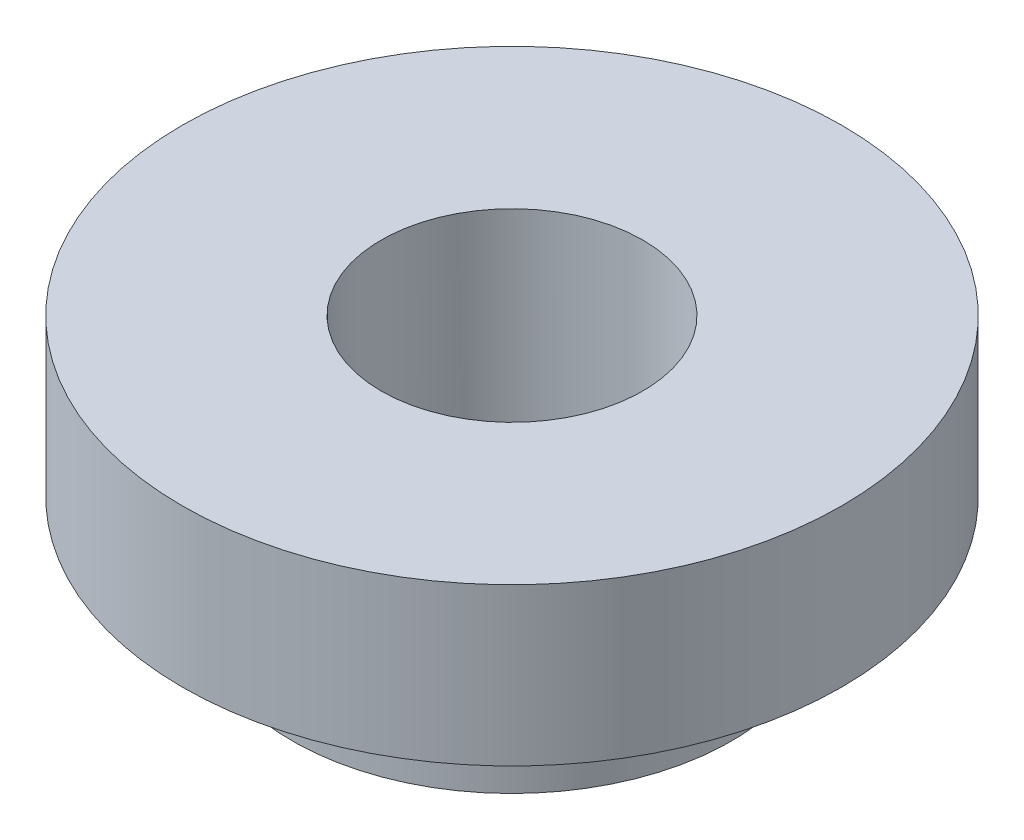
ISO-10303-21;
HEADER;
FILE_DESCRIPTION(('STEP AP214'),'2;1');
FILE_NAME('part.step','',(''),(''),'','','');
FILE_SCHEMA(('AUTOMOTIVE_DESIGN { 1 0 10303 214 1 1 1 1 }'));
ENDSEC;
DATA;
#1=APPLICATION_CONTEXT('core data for automotive mechanical design processes');
#2=APPLICATION_PROTOCOL_DEFINITION('international standard','automotive_design',2000,#1);
#3=PRODUCT_CONTEXT('',#1,'mechanical');
#4=PRODUCT('Part','Part','',(#3));
#5=PRODUCT_RELATED_PRODUCT_CATEGORY('part','',(#4));
#6=PRODUCT_DEFINITION_FORMATION('','',#4);
#7=PRODUCT_DEFINITION_CONTEXT('part definition',#1,'design');
#8=PRODUCT_DEFINITION('design','',#6,#7);
#9=PRODUCT_DEFINITION_SHAPE('','',#8);
#10=(LENGTH_UNIT() NAMED_UNIT(*) SI_UNIT(.MILLI.,.METRE.));
#11=(NAMED_UNIT(*) PLANE_ANGLE_UNIT() SI_UNIT($,.RADIAN.));
#12=(NAMED_UNIT(*) SI_UNIT($,.STERADIAN.) SOLID_ANGLE_UNIT());
#13=UNCERTAINTY_MEASURE_WITH_UNIT(LENGTH_MEASURE(1.E-05),#10,'distance_accuracy_value','');
#14=(GEOMETRIC_REPRESENTATION_CONTEXT(3) GLOBAL_UNCERTAINTY_ASSIGNED_CONTEXT((#13)) GLOBAL_UNIT_ASSIGNED_CONTEXT((#10,
#11,#12)) REPRESENTATION_CONTEXT('',''));
#15=CARTESIAN_POINT('',(0.,0.,0.));
#16=DIRECTION('',(0.,0.,1.));
#17=DIRECTION('',(1.,0.,0.));
#18=AXIS2_PLACEMENT_3D('',#15,#16,#17);
#19=CARTESIAN_POINT('',(0.,0.,0.));
#20=DIRECTION('',(0.,-1.,0.));
#21=DIRECTION('',(1.,0.,0.));
#22=AXIS2_PLACEMENT_3D('',#19,#20,#21);
#23=PLANE('',#22);
#24=CARTESIAN_POINT('',(0.,0.,0.));
#25=DIRECTION('',(0.,1.,0.));
#26=DIRECTION('',(0.,0.,1.));
#27=AXIS2_PLACEMENT_3D('',#24,#25,#26);
#28=CIRCLE('',#27,1.24999999999999);
#29=CARTESIAN_POINT('',(0.,0.,1.24999999999999));
#30=VERTEX_POINT('',#29);
#31=EDGE_CURVE('E56',#30,#30,#28,.T.);
#32=ORIENTED_EDGE('',*,*,#31,.F.);
#33=EDGE_LOOP('',(#32));
#34=FACE_BOUND('',#33,.T.);
#35=CARTESIAN_POINT('',(0.,0.,0.));
#36=DIRECTION('',(0.,1.,0.));
#37=DIRECTION('',(-1.,0.,0.));
#38=AXIS2_PLACEMENT_3D('',#35,#36,#37);
#39=CIRCLE('',#38,3.15);
#40=CARTESIAN_POINT('',(-3.15,0.,0.));
#41=VERTEX_POINT('',#40);
#42=EDGE_CURVE('E10',#41,#41,#39,.T.);
#43=ORIENTED_EDGE('',*,*,#42,.T.);
#44=EDGE_LOOP('',(#43));
#45=FACE_BOUND('',#44,.T.);
#46=ADVANCED_FACE('F34',(#34,#45),#23,.F.);
#47=CARTESIAN_POINT('',(0.,0.,0.));
#48=DIRECTION('',(0.,1.,0.));
#49=DIRECTION('',(-1.,0.,0.));
#50=AXIS2_PLACEMENT_3D('',#47,#48,#49);
#51=CYLINDRICAL_SURFACE('',#50,3.15);
#52=ORIENTED_EDGE('',*,*,#42,.F.);
#53=EDGE_LOOP('',(#52));
#54=FACE_BOUND('',#53,.T.);
#55=CARTESIAN_POINT('',(0.,-1.5,0.));
#56=DIRECTION('',(0.,1.,0.));
#57=DIRECTION('',(-1.,0.,0.));
#58=AXIS2_PLACEMENT_3D('',#55,#56,#57);
#59=CIRCLE('',#58,3.15);
#60=CARTESIAN_POINT('',(-3.15,-1.5,0.));
#61=VERTEX_POINT('',#60);
#62=EDGE_CURVE('E40',#61,#61,#59,.T.);
#63=ORIENTED_EDGE('',*,*,#62,.T.);
#64=EDGE_LOOP('',(#63));
#65=FACE_BOUND('',#64,.T.);
#66=ADVANCED_FACE('F64',(#54,#65),#51,.T.);
#67=CARTESIAN_POINT('',(3.15,-1.5,0.));
#68=DIRECTION('',(0.,1.,0.));
#69=DIRECTION('',(-1.,0.,0.));
#70=AXIS2_PLACEMENT_3D('',#67,#68,#69);
#71=PLANE('',#70);
#72=ORIENTED_EDGE('',*,*,#62,.F.);
#73=EDGE_LOOP('',(#72));
#74=FACE_BOUND('',#73,.T.);
#75=CARTESIAN_POINT('',(0.,-1.5,0.));
#76=DIRECTION('',(0.,1.,0.));
#77=DIRECTION('',(-1.,0.,0.));
#78=AXIS2_PLACEMENT_3D('',#75,#76,#77);
#79=CIRCLE('',#78,2.1);
#80=CARTESIAN_POINT('',(-2.1,-1.5,0.));
#81=VERTEX_POINT('',#80);
#82=EDGE_CURVE('E44',#81,#81,#79,.T.);
#83=ORIENTED_EDGE('',*,*,#82,.T.);
#84=EDGE_LOOP('',(#83));
#85=FACE_BOUND('',#84,.T.);
#86=ADVANCED_FACE('F68',(#74,#85),#71,.F.);
#87=CARTESIAN_POINT('',(0.,0.,0.));
#88=DIRECTION('',(0.,1.,0.));
#89=DIRECTION('',(-1.,0.,0.));
#90=AXIS2_PLACEMENT_3D('',#87,#88,#89);
#91=CYLINDRICAL_SURFACE('',#90,2.1);
#92=ORIENTED_EDGE('',*,*,#82,.F.);
#93=EDGE_LOOP('',(#92));
#94=FACE_BOUND('',#93,.T.);
#95=CARTESIAN_POINT('',(0.,-2.47,0.));
#96=DIRECTION('',(0.,1.,0.));
#97=DIRECTION('',(-1.,0.,0.));
#98=AXIS2_PLACEMENT_3D('',#95,#96,#97);
#99=CIRCLE('',#98,2.1);
#100=CARTESIAN_POINT('',(-2.1,-2.47,0.));
#101=VERTEX_POINT('',#100);
#102=EDGE_CURVE('E48',#101,#101,#99,.T.);
#103=ORIENTED_EDGE('',*,*,#102,.T.);
#104=EDGE_LOOP('',(#103));
#105=FACE_BOUND('',#104,.T.);
#106=ADVANCED_FACE('F73',(#94,#105),#91,.T.);
#107=CARTESIAN_POINT('',(2.1,-2.47,0.));
#108=DIRECTION('',(0.,1.,0.));
#109=DIRECTION('',(-1.,0.,0.));
#110=AXIS2_PLACEMENT_3D('',#107,#108,#109);
#111=PLANE('',#110);
#112=CARTESIAN_POINT('',(0.,-2.47,0.));
#113=DIRECTION('',(0.,1.,0.));
#114=DIRECTION('',(-1.,0.,0.));
#115=AXIS2_PLACEMENT_3D('',#112,#113,#114);
#116=CIRCLE('',#115,1.24999999999999);
#117=CARTESIAN_POINT('',(-1.24999999999999,-2.47,0.));
#118=VERTEX_POINT('',#117);
#119=EDGE_CURVE('E53',#118,#118,#116,.T.);
#120=ORIENTED_EDGE('',*,*,#119,.T.);
#121=EDGE_LOOP('',(#120));
#122=FACE_BOUND('',#121,.T.);
#123=ORIENTED_EDGE('',*,*,#102,.F.);
#124=EDGE_LOOP('',(#123));
#125=FACE_BOUND('',#124,.T.);
#126=ADVANCED_FACE('F79',(#122,#125),#111,.F.);
#127=CARTESIAN_POINT('',(0.,0.,0.));
#128=DIRECTION('',(0.,1.,0.));
#129=DIRECTION('',(0.,0.,1.));
#130=AXIS2_PLACEMENT_3D('',#127,#128,#129);
#131=CYLINDRICAL_SURFACE('',#130,1.24999999999999);
#132=ORIENTED_EDGE('',*,*,#31,.T.);
#133=EDGE_LOOP('',(#132));
#134=FACE_BOUND('',#133,.T.);
#135=ORIENTED_EDGE('',*,*,#119,.F.);
#136=EDGE_LOOP('',(#135));
#137=FACE_BOUND('',#136,.T.);
#138=ADVANCED_FACE('F60',(#134,#137),#131,.F.);
#139=CLOSED_SHELL('',(#46,#66,#86,#106,#126,#138));
#140=MANIFOLD_SOLID_BREP('B2',#139);
#141=ADVANCED_BREP_SHAPE_REPRESENTATION('',(#18,#140),#14);
#142=SHAPE_DEFINITION_REPRESENTATION(#9,#141);
ENDSEC;
END-ISO-10303-21;
